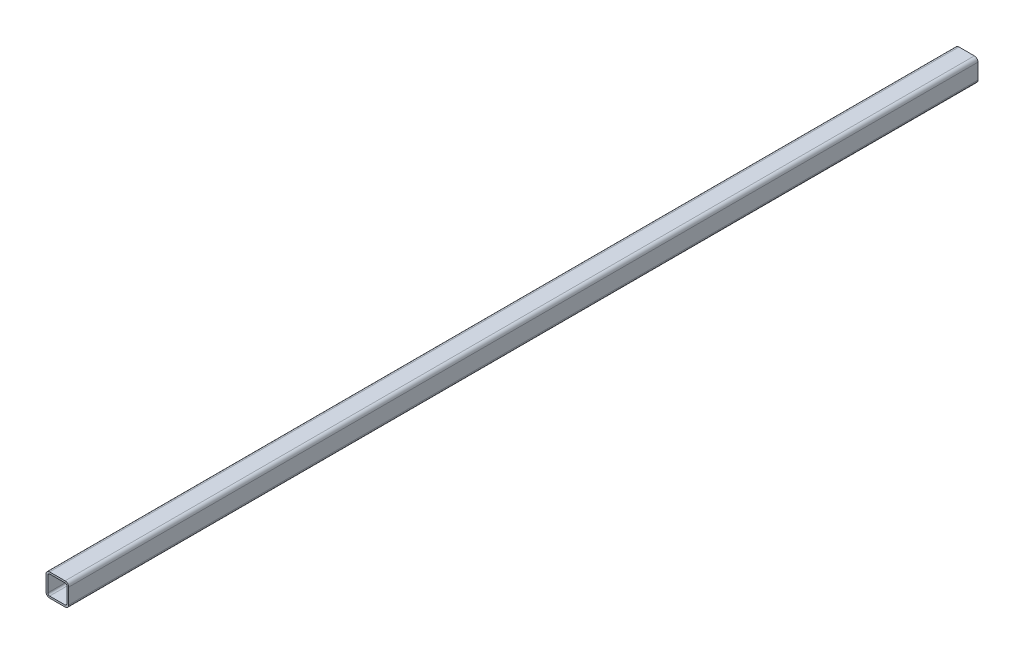
ISO-10303-21;
HEADER;
FILE_DESCRIPTION(('STEP AP214'),'2;1');
FILE_NAME('part.step','',(''),(''),'','','');
FILE_SCHEMA(('AUTOMOTIVE_DESIGN { 1 0 10303 214 1 1 1 1 }'));
ENDSEC;
DATA;
#1=APPLICATION_CONTEXT('core data for automotive mechanical design processes');
#2=APPLICATION_PROTOCOL_DEFINITION('international standard','automotive_design',2000,#1);
#3=PRODUCT_CONTEXT('',#1,'mechanical');
#4=PRODUCT('Part','Part','',(#3));
#5=PRODUCT_RELATED_PRODUCT_CATEGORY('part','',(#4));
#6=PRODUCT_DEFINITION_FORMATION('','',#4);
#7=PRODUCT_DEFINITION_CONTEXT('part definition',#1,'design');
#8=PRODUCT_DEFINITION('design','',#6,#7);
#9=PRODUCT_DEFINITION_SHAPE('','',#8);
#10=(LENGTH_UNIT() NAMED_UNIT(*) SI_UNIT(.MILLI.,.METRE.));
#11=(NAMED_UNIT(*) PLANE_ANGLE_UNIT() SI_UNIT($,.RADIAN.));
#12=(NAMED_UNIT(*) SI_UNIT($,.STERADIAN.) SOLID_ANGLE_UNIT());
#13=UNCERTAINTY_MEASURE_WITH_UNIT(LENGTH_MEASURE(1.E-05),#10,'distance_accuracy_value','');
#14=(GEOMETRIC_REPRESENTATION_CONTEXT(3) GLOBAL_UNCERTAINTY_ASSIGNED_CONTEXT((#13)) GLOBAL_UNIT_ASSIGNED_CONTEXT((#10,
#11,#12)) REPRESENTATION_CONTEXT('',''));
#15=CARTESIAN_POINT('',(0.,0.,0.));
#16=DIRECTION('',(0.,0.,1.));
#17=DIRECTION('',(1.,0.,0.));
#18=AXIS2_PLACEMENT_3D('',#15,#16,#17);
#19=CARTESIAN_POINT('',(33.6,33.6,800.));
#20=DIRECTION('',(0.,0.,1.));
#21=DIRECTION('',(1.,0.,0.));
#22=AXIS2_PLACEMENT_3D('',#19,#20,#21);
#23=PLANE('',#22);
#24=CARTESIAN_POINT('',(33.6,33.6,800.));
#25=DIRECTION('',(0.,0.,1.));
#26=DIRECTION('',(1.,0.,0.));
#27=AXIS2_PLACEMENT_3D('',#24,#25,#26);
#28=CIRCLE('',#27,6.4);
#29=CARTESIAN_POINT('',(40.,33.6,800.));
#30=VERTEX_POINT('',#29);
#31=CARTESIAN_POINT('',(33.6,40.,800.));
#32=VERTEX_POINT('',#31);
#33=EDGE_CURVE('E212',#30,#32,#28,.T.);
#34=ORIENTED_EDGE('',*,*,#33,.T.);
#35=DIRECTION('',(-1.,0.,0.));
#36=VECTOR('',#35,1.);
#37=CARTESIAN_POINT('',(33.6,40.,800.));
#38=LINE('',#37,#36);
#39=CARTESIAN_POINT('',(6.4,40.,800.));
#40=VERTEX_POINT('',#39);
#41=EDGE_CURVE('E215',#32,#40,#38,.T.);
#42=ORIENTED_EDGE('',*,*,#41,.T.);
#43=CARTESIAN_POINT('',(6.4,33.6,800.));
#44=DIRECTION('',(0.,0.,1.));
#45=DIRECTION('',(1.,0.,0.));
#46=AXIS2_PLACEMENT_3D('',#43,#44,#45);
#47=CIRCLE('',#46,6.40000000000001);
#48=CARTESIAN_POINT('',(0.,33.6,800.));
#49=VERTEX_POINT('',#48);
#50=EDGE_CURVE('E218',#40,#49,#47,.T.);
#51=ORIENTED_EDGE('',*,*,#50,.T.);
#52=DIRECTION('',(0.,-1.,0.));
#53=VECTOR('',#52,1.);
#54=CARTESIAN_POINT('',(0.,6.4,800.));
#55=LINE('',#54,#53);
#56=CARTESIAN_POINT('',(0.,6.4,800.));
#57=VERTEX_POINT('',#56);
#58=EDGE_CURVE('E220',#49,#57,#55,.T.);
#59=ORIENTED_EDGE('',*,*,#58,.T.);
#60=CARTESIAN_POINT('',(6.4,6.4,800.));
#61=DIRECTION('',(0.,0.,1.));
#62=DIRECTION('',(1.,0.,0.));
#63=AXIS2_PLACEMENT_3D('',#60,#61,#62);
#64=CIRCLE('',#63,6.4);
#65=CARTESIAN_POINT('',(6.4,0.,800.));
#66=VERTEX_POINT('',#65);
#67=EDGE_CURVE('E222',#57,#66,#64,.T.);
#68=ORIENTED_EDGE('',*,*,#67,.T.);
#69=DIRECTION('',(1.,0.,0.));
#70=VECTOR('',#69,1.);
#71=CARTESIAN_POINT('',(6.4,0.,800.));
#72=LINE('',#71,#70);
#73=CARTESIAN_POINT('',(33.6,0.,800.));
#74=VERTEX_POINT('',#73);
#75=EDGE_CURVE('E224',#66,#74,#72,.T.);
#76=ORIENTED_EDGE('',*,*,#75,.T.);
#77=CARTESIAN_POINT('',(33.6,6.4,800.));
#78=DIRECTION('',(0.,0.,1.));
#79=DIRECTION('',(1.,0.,0.));
#80=AXIS2_PLACEMENT_3D('',#77,#78,#79);
#81=CIRCLE('',#80,6.4);
#82=CARTESIAN_POINT('',(40.,6.4,800.));
#83=VERTEX_POINT('',#82);
#84=EDGE_CURVE('E226',#74,#83,#81,.T.);
#85=ORIENTED_EDGE('',*,*,#84,.T.);
#86=DIRECTION('',(0.,1.,0.));
#87=VECTOR('',#86,1.);
#88=CARTESIAN_POINT('',(40.,33.6,800.));
#89=LINE('',#88,#87);
#90=EDGE_CURVE('E228',#83,#30,#89,.T.);
#91=ORIENTED_EDGE('',*,*,#90,.T.);
#92=EDGE_LOOP('',(#34,#42,#51,#59,#68,#76,#85,#91));
#93=FACE_BOUND('',#92,.T.);
#94=DIRECTION('',(0.,-1.,0.));
#95=VECTOR('',#94,1.);
#96=CARTESIAN_POINT('',(3.2,6.4,800.));
#97=LINE('',#96,#95);
#98=CARTESIAN_POINT('',(3.2,33.6,800.));
#99=VERTEX_POINT('',#98);
#100=CARTESIAN_POINT('',(3.2,6.4,800.));
#101=VERTEX_POINT('',#100);
#102=EDGE_CURVE('E155',#99,#101,#97,.T.);
#103=ORIENTED_EDGE('',*,*,#102,.F.);
#104=CARTESIAN_POINT('',(6.4,33.6,800.));
#105=DIRECTION('',(0.,0.,1.));
#106=DIRECTION('',(1.,0.,0.));
#107=AXIS2_PLACEMENT_3D('',#104,#105,#106);
#108=CIRCLE('',#107,3.2);
#109=CARTESIAN_POINT('',(6.4,36.8,800.));
#110=VERTEX_POINT('',#109);
#111=EDGE_CURVE('E147',#110,#99,#108,.T.);
#112=ORIENTED_EDGE('',*,*,#111,.F.);
#113=DIRECTION('',(-1.,0.,0.));
#114=VECTOR('',#113,1.);
#115=CARTESIAN_POINT('',(33.6,36.8,800.));
#116=LINE('',#115,#114);
#117=CARTESIAN_POINT('',(33.6,36.8,800.));
#118=VERTEX_POINT('',#117);
#119=EDGE_CURVE('E180',#118,#110,#116,.T.);
#120=ORIENTED_EDGE('',*,*,#119,.F.);
#121=CARTESIAN_POINT('',(33.6,33.6,800.));
#122=DIRECTION('',(0.,0.,1.));
#123=DIRECTION('',(1.,0.,0.));
#124=AXIS2_PLACEMENT_3D('',#121,#122,#123);
#125=CIRCLE('',#124,3.2);
#126=CARTESIAN_POINT('',(36.8,33.6,800.));
#127=VERTEX_POINT('',#126);
#128=EDGE_CURVE('E178',#127,#118,#125,.T.);
#129=ORIENTED_EDGE('',*,*,#128,.F.);
#130=DIRECTION('',(0.,1.,0.));
#131=VECTOR('',#130,1.);
#132=CARTESIAN_POINT('',(36.8,33.6,800.));
#133=LINE('',#132,#131);
#134=CARTESIAN_POINT('',(36.8,6.4,800.));
#135=VERTEX_POINT('',#134);
#136=EDGE_CURVE('E176',#135,#127,#133,.T.);
#137=ORIENTED_EDGE('',*,*,#136,.F.);
#138=CARTESIAN_POINT('',(33.6,6.4,800.));
#139=DIRECTION('',(0.,0.,1.));
#140=DIRECTION('',(1.,0.,0.));
#141=AXIS2_PLACEMENT_3D('',#138,#139,#140);
#142=CIRCLE('',#141,3.20000000000001);
#143=CARTESIAN_POINT('',(33.6,3.2,800.));
#144=VERTEX_POINT('',#143);
#145=EDGE_CURVE('E174',#144,#135,#142,.T.);
#146=ORIENTED_EDGE('',*,*,#145,.F.);
#147=DIRECTION('',(1.,0.,0.));
#148=VECTOR('',#147,1.);
#149=CARTESIAN_POINT('',(6.4,3.2,800.));
#150=LINE('',#149,#148);
#151=CARTESIAN_POINT('',(6.4,3.2,800.));
#152=VERTEX_POINT('',#151);
#153=EDGE_CURVE('E170',#152,#144,#150,.T.);
#154=ORIENTED_EDGE('',*,*,#153,.F.);
#155=CARTESIAN_POINT('',(6.4,6.4,800.));
#156=DIRECTION('',(0.,0.,1.));
#157=DIRECTION('',(1.,0.,0.));
#158=AXIS2_PLACEMENT_3D('',#155,#156,#157);
#159=CIRCLE('',#158,3.2);
#160=EDGE_CURVE('E168',#101,#152,#159,.T.);
#161=ORIENTED_EDGE('',*,*,#160,.F.);
#162=EDGE_LOOP('',(#103,#112,#120,#129,#137,#146,#154,#161));
#163=FACE_BOUND('',#162,.T.);
#164=ADVANCED_FACE('F34',(#93,#163),#23,.T.);
#165=CARTESIAN_POINT('',(33.6,33.6,-800.));
#166=DIRECTION('',(0.,0.,1.));
#167=DIRECTION('',(1.,0.,0.));
#168=AXIS2_PLACEMENT_3D('',#165,#166,#167);
#169=PLANE('',#168);
#170=CARTESIAN_POINT('',(33.6,33.6,-800.));
#171=DIRECTION('',(0.,0.,1.));
#172=DIRECTION('',(1.,0.,0.));
#173=AXIS2_PLACEMENT_3D('',#170,#171,#172);
#174=CIRCLE('',#173,6.4);
#175=CARTESIAN_POINT('',(40.,33.6,-800.));
#176=VERTEX_POINT('',#175);
#177=CARTESIAN_POINT('',(33.6,40.,-800.));
#178=VERTEX_POINT('',#177);
#179=EDGE_CURVE('E163',#176,#178,#174,.T.);
#180=ORIENTED_EDGE('',*,*,#179,.F.);
#181=DIRECTION('',(0.,1.,0.));
#182=VECTOR('',#181,1.);
#183=CARTESIAN_POINT('',(40.,33.6,-800.));
#184=LINE('',#183,#182);
#185=CARTESIAN_POINT('',(40.,6.4,-800.));
#186=VERTEX_POINT('',#185);
#187=EDGE_CURVE('E216',#186,#176,#184,.T.);
#188=ORIENTED_EDGE('',*,*,#187,.F.);
#189=CARTESIAN_POINT('',(33.6,6.4,-800.));
#190=DIRECTION('',(0.,0.,1.));
#191=DIRECTION('',(1.,0.,0.));
#192=AXIS2_PLACEMENT_3D('',#189,#190,#191);
#193=CIRCLE('',#192,6.4);
#194=CARTESIAN_POINT('',(33.6,0.,-800.));
#195=VERTEX_POINT('',#194);
#196=EDGE_CURVE('E243',#195,#186,#193,.T.);
#197=ORIENTED_EDGE('',*,*,#196,.F.);
#198=DIRECTION('',(1.,0.,0.));
#199=VECTOR('',#198,1.);
#200=CARTESIAN_POINT('',(6.4,0.,-800.));
#201=LINE('',#200,#199);
#202=CARTESIAN_POINT('',(6.4,0.,-800.));
#203=VERTEX_POINT('',#202);
#204=EDGE_CURVE('E241',#203,#195,#201,.T.);
#205=ORIENTED_EDGE('',*,*,#204,.F.);
#206=CARTESIAN_POINT('',(6.4,6.4,-800.));
#207=DIRECTION('',(0.,0.,1.));
#208=DIRECTION('',(1.,0.,0.));
#209=AXIS2_PLACEMENT_3D('',#206,#207,#208);
#210=CIRCLE('',#209,6.4);
#211=CARTESIAN_POINT('',(0.,6.4,-800.));
#212=VERTEX_POINT('',#211);
#213=EDGE_CURVE('E239',#212,#203,#210,.T.);
#214=ORIENTED_EDGE('',*,*,#213,.F.);
#215=DIRECTION('',(0.,-1.,0.));
#216=VECTOR('',#215,1.);
#217=CARTESIAN_POINT('',(0.,6.4,-800.));
#218=LINE('',#217,#216);
#219=CARTESIAN_POINT('',(0.,33.6,-800.));
#220=VERTEX_POINT('',#219);
#221=EDGE_CURVE('E237',#220,#212,#218,.T.);
#222=ORIENTED_EDGE('',*,*,#221,.F.);
#223=CARTESIAN_POINT('',(6.4,33.6,-800.));
#224=DIRECTION('',(0.,0.,1.));
#225=DIRECTION('',(1.,0.,0.));
#226=AXIS2_PLACEMENT_3D('',#223,#224,#225);
#227=CIRCLE('',#226,6.40000000000001);
#228=CARTESIAN_POINT('',(6.4,40.,-800.));
#229=VERTEX_POINT('',#228);
#230=EDGE_CURVE('E235',#229,#220,#227,.T.);
#231=ORIENTED_EDGE('',*,*,#230,.F.);
#232=DIRECTION('',(-1.,0.,0.));
#233=VECTOR('',#232,1.);
#234=CARTESIAN_POINT('',(33.6,40.,-800.));
#235=LINE('',#234,#233);
#236=EDGE_CURVE('E233',#178,#229,#235,.T.);
#237=ORIENTED_EDGE('',*,*,#236,.F.);
#238=EDGE_LOOP('',(#180,#188,#197,#205,#214,#222,#231,#237));
#239=FACE_BOUND('',#238,.T.);
#240=CARTESIAN_POINT('',(6.4,33.6,-800.));
#241=DIRECTION('',(0.,0.,1.));
#242=DIRECTION('',(1.,0.,0.));
#243=AXIS2_PLACEMENT_3D('',#240,#241,#242);
#244=CIRCLE('',#243,3.2);
#245=CARTESIAN_POINT('',(6.4,36.8,-800.));
#246=VERTEX_POINT('',#245);
#247=CARTESIAN_POINT('',(3.2,33.6,-800.));
#248=VERTEX_POINT('',#247);
#249=EDGE_CURVE('E57',#246,#248,#244,.T.);
#250=ORIENTED_EDGE('',*,*,#249,.T.);
#251=DIRECTION('',(0.,-1.,0.));
#252=VECTOR('',#251,1.);
#253=CARTESIAN_POINT('',(3.2,6.4,-800.));
#254=LINE('',#253,#252);
#255=CARTESIAN_POINT('',(3.2,6.4,-800.));
#256=VERTEX_POINT('',#255);
#257=EDGE_CURVE('E162',#248,#256,#254,.T.);
#258=ORIENTED_EDGE('',*,*,#257,.T.);
#259=CARTESIAN_POINT('',(6.4,6.4,-800.));
#260=DIRECTION('',(0.,0.,1.));
#261=DIRECTION('',(1.,0.,0.));
#262=AXIS2_PLACEMENT_3D('',#259,#260,#261);
#263=CIRCLE('',#262,3.2);
#264=CARTESIAN_POINT('',(6.4,3.2,-800.));
#265=VERTEX_POINT('',#264);
#266=EDGE_CURVE('E184',#256,#265,#263,.T.);
#267=ORIENTED_EDGE('',*,*,#266,.T.);
#268=DIRECTION('',(1.,0.,0.));
#269=VECTOR('',#268,1.);
#270=CARTESIAN_POINT('',(6.4,3.2,-800.));
#271=LINE('',#270,#269);
#272=CARTESIAN_POINT('',(33.6,3.2,-800.));
#273=VERTEX_POINT('',#272);
#274=EDGE_CURVE('E187',#265,#273,#271,.T.);
#275=ORIENTED_EDGE('',*,*,#274,.T.);
#276=CARTESIAN_POINT('',(33.6,6.4,-800.));
#277=DIRECTION('',(0.,0.,1.));
#278=DIRECTION('',(1.,0.,0.));
#279=AXIS2_PLACEMENT_3D('',#276,#277,#278);
#280=CIRCLE('',#279,3.20000000000001);
#281=CARTESIAN_POINT('',(36.8,6.4,-800.));
#282=VERTEX_POINT('',#281);
#283=EDGE_CURVE('E190',#273,#282,#280,.T.);
#284=ORIENTED_EDGE('',*,*,#283,.T.);
#285=DIRECTION('',(0.,1.,0.));
#286=VECTOR('',#285,1.);
#287=CARTESIAN_POINT('',(36.8,33.6,-800.));
#288=LINE('',#287,#286);
#289=CARTESIAN_POINT('',(36.8,33.6,-800.));
#290=VERTEX_POINT('',#289);
#291=EDGE_CURVE('E193',#282,#290,#288,.T.);
#292=ORIENTED_EDGE('',*,*,#291,.T.);
#293=CARTESIAN_POINT('',(33.6,33.6,-800.));
#294=DIRECTION('',(0.,0.,1.));
#295=DIRECTION('',(1.,0.,0.));
#296=AXIS2_PLACEMENT_3D('',#293,#294,#295);
#297=CIRCLE('',#296,3.2);
#298=CARTESIAN_POINT('',(33.6,36.8,-800.));
#299=VERTEX_POINT('',#298);
#300=EDGE_CURVE('E196',#290,#299,#297,.T.);
#301=ORIENTED_EDGE('',*,*,#300,.T.);
#302=DIRECTION('',(-1.,0.,0.));
#303=VECTOR('',#302,1.);
#304=CARTESIAN_POINT('',(33.6,36.8,-800.));
#305=LINE('',#304,#303);
#306=EDGE_CURVE('E156',#299,#246,#305,.T.);
#307=ORIENTED_EDGE('',*,*,#306,.T.);
#308=EDGE_LOOP('',(#250,#258,#267,#275,#284,#292,#301,#307));
#309=FACE_BOUND('',#308,.T.);
#310=ADVANCED_FACE('F273',(#239,#309),#169,.F.);
#311=CARTESIAN_POINT('',(33.6,33.6,800.));
#312=DIRECTION('',(0.,0.,-1.));
#313=DIRECTION('',(-1.,0.,0.));
#314=AXIS2_PLACEMENT_3D('',#311,#312,#313);
#315=CYLINDRICAL_SURFACE('',#314,6.4);
#316=ORIENTED_EDGE('',*,*,#179,.T.);
#317=DIRECTION('',(0.,0.,-1.));
#318=VECTOR('',#317,1.);
#319=CARTESIAN_POINT('',(33.6,40.,800.));
#320=LINE('',#319,#318);
#321=EDGE_CURVE('E11',#32,#178,#320,.T.);
#322=ORIENTED_EDGE('',*,*,#321,.F.);
#323=ORIENTED_EDGE('',*,*,#33,.F.);
#324=DIRECTION('',(0.,0.,-1.));
#325=VECTOR('',#324,1.);
#326=CARTESIAN_POINT('',(40.,33.6,800.));
#327=LINE('',#326,#325);
#328=EDGE_CURVE('E230',#30,#176,#327,.T.);
#329=ORIENTED_EDGE('',*,*,#328,.T.);
#330=EDGE_LOOP('',(#316,#322,#323,#329));
#331=FACE_BOUND('',#330,.T.);
#332=ADVANCED_FACE('F36',(#331),#315,.T.);
#333=CARTESIAN_POINT('',(33.6,40.,800.));
#334=DIRECTION('',(0.,-1.,0.));
#335=DIRECTION('',(0.,0.,-1.));
#336=AXIS2_PLACEMENT_3D('',#333,#334,#335);
#337=PLANE('',#336);
#338=ORIENTED_EDGE('',*,*,#236,.T.);
#339=DIRECTION('',(0.,0.,-1.));
#340=VECTOR('',#339,1.);
#341=CARTESIAN_POINT('',(6.4,40.,800.));
#342=LINE('',#341,#340);
#343=EDGE_CURVE('E42',#40,#229,#342,.T.);
#344=ORIENTED_EDGE('',*,*,#343,.F.);
#345=ORIENTED_EDGE('',*,*,#41,.F.);
#346=ORIENTED_EDGE('',*,*,#321,.T.);
#347=EDGE_LOOP('',(#338,#344,#345,#346));
#348=FACE_BOUND('',#347,.T.);
#349=ADVANCED_FACE('F290',(#348),#337,.F.);
#350=CARTESIAN_POINT('',(6.4,33.6,800.));
#351=DIRECTION('',(0.,0.,-1.));
#352=DIRECTION('',(-1.,0.,0.));
#353=AXIS2_PLACEMENT_3D('',#350,#351,#352);
#354=CYLINDRICAL_SURFACE('',#353,6.40000000000001);
#355=ORIENTED_EDGE('',*,*,#230,.T.);
#356=DIRECTION('',(0.,0.,-1.));
#357=VECTOR('',#356,1.);
#358=CARTESIAN_POINT('',(0.,33.6,800.));
#359=LINE('',#358,#357);
#360=EDGE_CURVE('E260',#49,#220,#359,.T.);
#361=ORIENTED_EDGE('',*,*,#360,.F.);
#362=ORIENTED_EDGE('',*,*,#50,.F.);
#363=ORIENTED_EDGE('',*,*,#343,.T.);
#364=EDGE_LOOP('',(#355,#361,#362,#363));
#365=FACE_BOUND('',#364,.T.);
#366=ADVANCED_FACE('F267',(#365),#354,.T.);
#367=CARTESIAN_POINT('',(0.,6.4,800.));
#368=DIRECTION('',(1.,0.,0.));
#369=DIRECTION('',(0.,1.,0.));
#370=AXIS2_PLACEMENT_3D('',#367,#368,#369);
#371=PLANE('',#370);
#372=ORIENTED_EDGE('',*,*,#221,.T.);
#373=DIRECTION('',(0.,0.,-1.));
#374=VECTOR('',#373,1.);
#375=CARTESIAN_POINT('',(0.,6.4,800.));
#376=LINE('',#375,#374);
#377=EDGE_CURVE('E257',#57,#212,#376,.T.);
#378=ORIENTED_EDGE('',*,*,#377,.F.);
#379=ORIENTED_EDGE('',*,*,#58,.F.);
#380=ORIENTED_EDGE('',*,*,#360,.T.);
#381=EDGE_LOOP('',(#372,#378,#379,#380));
#382=FACE_BOUND('',#381,.T.);
#383=ADVANCED_FACE('F279',(#382),#371,.F.);
#384=CARTESIAN_POINT('',(6.4,6.4,800.));
#385=DIRECTION('',(0.,0.,-1.));
#386=DIRECTION('',(-1.,0.,0.));
#387=AXIS2_PLACEMENT_3D('',#384,#385,#386);
#388=CYLINDRICAL_SURFACE('',#387,6.4);
#389=ORIENTED_EDGE('',*,*,#213,.T.);
#390=DIRECTION('',(0.,0.,-1.));
#391=VECTOR('',#390,1.);
#392=CARTESIAN_POINT('',(6.4,0.,800.));
#393=LINE('',#392,#391);
#394=EDGE_CURVE('E254',#66,#203,#393,.T.);
#395=ORIENTED_EDGE('',*,*,#394,.F.);
#396=ORIENTED_EDGE('',*,*,#67,.F.);
#397=ORIENTED_EDGE('',*,*,#377,.T.);
#398=EDGE_LOOP('',(#389,#395,#396,#397));
#399=FACE_BOUND('',#398,.T.);
#400=ADVANCED_FACE('F283',(#399),#388,.T.);
#401=CARTESIAN_POINT('',(6.4,0.,800.));
#402=DIRECTION('',(0.,1.,0.));
#403=DIRECTION('',(-1.,0.,0.));
#404=AXIS2_PLACEMENT_3D('',#401,#402,#403);
#405=PLANE('',#404);
#406=ORIENTED_EDGE('',*,*,#204,.T.);
#407=DIRECTION('',(0.,0.,-1.));
#408=VECTOR('',#407,1.);
#409=CARTESIAN_POINT('',(33.6,0.,800.));
#410=LINE('',#409,#408);
#411=EDGE_CURVE('E251',#74,#195,#410,.T.);
#412=ORIENTED_EDGE('',*,*,#411,.F.);
#413=ORIENTED_EDGE('',*,*,#75,.F.);
#414=ORIENTED_EDGE('',*,*,#394,.T.);
#415=EDGE_LOOP('',(#406,#412,#413,#414));
#416=FACE_BOUND('',#415,.T.);
#417=ADVANCED_FACE('F303',(#416),#405,.F.);
#418=CARTESIAN_POINT('',(33.6,6.4,800.));
#419=DIRECTION('',(0.,0.,-1.));
#420=DIRECTION('',(-1.,0.,0.));
#421=AXIS2_PLACEMENT_3D('',#418,#419,#420);
#422=CYLINDRICAL_SURFACE('',#421,6.4);
#423=ORIENTED_EDGE('',*,*,#196,.T.);
#424=DIRECTION('',(0.,0.,-1.));
#425=VECTOR('',#424,1.);
#426=CARTESIAN_POINT('',(40.,6.4,800.));
#427=LINE('',#426,#425);
#428=EDGE_CURVE('E248',#83,#186,#427,.T.);
#429=ORIENTED_EDGE('',*,*,#428,.F.);
#430=ORIENTED_EDGE('',*,*,#84,.F.);
#431=ORIENTED_EDGE('',*,*,#411,.T.);
#432=EDGE_LOOP('',(#423,#429,#430,#431));
#433=FACE_BOUND('',#432,.T.);
#434=ADVANCED_FACE('F301',(#433),#422,.T.);
#435=CARTESIAN_POINT('',(40.,33.6,800.));
#436=DIRECTION('',(-1.,0.,0.));
#437=DIRECTION('',(0.,0.,1.));
#438=AXIS2_PLACEMENT_3D('',#435,#436,#437);
#439=PLANE('',#438);
#440=ORIENTED_EDGE('',*,*,#187,.T.);
#441=ORIENTED_EDGE('',*,*,#328,.F.);
#442=ORIENTED_EDGE('',*,*,#90,.F.);
#443=ORIENTED_EDGE('',*,*,#428,.T.);
#444=EDGE_LOOP('',(#440,#441,#442,#443));
#445=FACE_BOUND('',#444,.T.);
#446=ADVANCED_FACE('F296',(#445),#439,.F.);
#447=CARTESIAN_POINT('',(6.4,33.6,800.));
#448=DIRECTION('',(0.,0.,-1.));
#449=DIRECTION('',(-1.,0.,0.));
#450=AXIS2_PLACEMENT_3D('',#447,#448,#449);
#451=CYLINDRICAL_SURFACE('',#450,3.2);
#452=ORIENTED_EDGE('',*,*,#249,.F.);
#453=DIRECTION('',(0.,0.,-1.));
#454=VECTOR('',#453,1.);
#455=CARTESIAN_POINT('',(6.4,36.8,800.));
#456=LINE('',#455,#454);
#457=EDGE_CURVE('E151',#110,#246,#456,.T.);
#458=ORIENTED_EDGE('',*,*,#457,.F.);
#459=ORIENTED_EDGE('',*,*,#111,.T.);
#460=DIRECTION('',(0.,0.,-1.));
#461=VECTOR('',#460,1.);
#462=CARTESIAN_POINT('',(3.2,33.6,800.));
#463=LINE('',#462,#461);
#464=EDGE_CURVE('E150',#99,#248,#463,.T.);
#465=ORIENTED_EDGE('',*,*,#464,.T.);
#466=EDGE_LOOP('',(#452,#458,#459,#465));
#467=FACE_BOUND('',#466,.T.);
#468=ADVANCED_FACE('F149',(#467),#451,.F.);
#469=CARTESIAN_POINT('',(3.2,6.4,800.));
#470=DIRECTION('',(1.,0.,0.));
#471=DIRECTION('',(0.,0.,-1.));
#472=AXIS2_PLACEMENT_3D('',#469,#470,#471);
#473=PLANE('',#472);
#474=ORIENTED_EDGE('',*,*,#257,.F.);
#475=ORIENTED_EDGE('',*,*,#464,.F.);
#476=ORIENTED_EDGE('',*,*,#102,.T.);
#477=DIRECTION('',(0.,0.,-1.));
#478=VECTOR('',#477,1.);
#479=CARTESIAN_POINT('',(3.2,6.4,800.));
#480=LINE('',#479,#478);
#481=EDGE_CURVE('E164',#101,#256,#480,.T.);
#482=ORIENTED_EDGE('',*,*,#481,.T.);
#483=EDGE_LOOP('',(#474,#475,#476,#482));
#484=FACE_BOUND('',#483,.T.);
#485=ADVANCED_FACE('F159',(#484),#473,.T.);
#486=CARTESIAN_POINT('',(6.4,6.4,800.));
#487=DIRECTION('',(0.,0.,-1.));
#488=DIRECTION('',(-1.,0.,0.));
#489=AXIS2_PLACEMENT_3D('',#486,#487,#488);
#490=CYLINDRICAL_SURFACE('',#489,3.2);
#491=ORIENTED_EDGE('',*,*,#266,.F.);
#492=ORIENTED_EDGE('',*,*,#481,.F.);
#493=ORIENTED_EDGE('',*,*,#160,.T.);
#494=DIRECTION('',(0.,0.,-1.));
#495=VECTOR('',#494,1.);
#496=CARTESIAN_POINT('',(6.4,3.2,800.));
#497=LINE('',#496,#495);
#498=EDGE_CURVE('E209',#152,#265,#497,.T.);
#499=ORIENTED_EDGE('',*,*,#498,.T.);
#500=EDGE_LOOP('',(#491,#492,#493,#499));
#501=FACE_BOUND('',#500,.T.);
#502=ADVANCED_FACE('F328',(#501),#490,.F.);
#503=CARTESIAN_POINT('',(6.4,3.2,800.));
#504=DIRECTION('',(0.,1.,0.));
#505=DIRECTION('',(-1.,0.,0.));
#506=AXIS2_PLACEMENT_3D('',#503,#504,#505);
#507=PLANE('',#506);
#508=ORIENTED_EDGE('',*,*,#274,.F.);
#509=ORIENTED_EDGE('',*,*,#498,.F.);
#510=ORIENTED_EDGE('',*,*,#153,.T.);
#511=DIRECTION('',(0.,0.,-1.));
#512=VECTOR('',#511,1.);
#513=CARTESIAN_POINT('',(33.6,3.2,800.));
#514=LINE('',#513,#512);
#515=EDGE_CURVE('E207',#144,#273,#514,.T.);
#516=ORIENTED_EDGE('',*,*,#515,.T.);
#517=EDGE_LOOP('',(#508,#509,#510,#516));
#518=FACE_BOUND('',#517,.T.);
#519=ADVANCED_FACE('F332',(#518),#507,.T.);
#520=CARTESIAN_POINT('',(33.6,6.4,800.));
#521=DIRECTION('',(0.,0.,-1.));
#522=DIRECTION('',(-1.,0.,0.));
#523=AXIS2_PLACEMENT_3D('',#520,#521,#522);
#524=CYLINDRICAL_SURFACE('',#523,3.20000000000001);
#525=ORIENTED_EDGE('',*,*,#283,.F.);
#526=ORIENTED_EDGE('',*,*,#515,.F.);
#527=ORIENTED_EDGE('',*,*,#145,.T.);
#528=DIRECTION('',(0.,0.,-1.));
#529=VECTOR('',#528,1.);
#530=CARTESIAN_POINT('',(36.8,6.4,800.));
#531=LINE('',#530,#529);
#532=EDGE_CURVE('E205',#135,#282,#531,.T.);
#533=ORIENTED_EDGE('',*,*,#532,.T.);
#534=EDGE_LOOP('',(#525,#526,#527,#533));
#535=FACE_BOUND('',#534,.T.);
#536=ADVANCED_FACE('F338',(#535),#524,.F.);
#537=CARTESIAN_POINT('',(36.8,33.6,800.));
#538=DIRECTION('',(-1.,0.,0.));
#539=DIRECTION('',(0.,-1.,0.));
#540=AXIS2_PLACEMENT_3D('',#537,#538,#539);
#541=PLANE('',#540);
#542=ORIENTED_EDGE('',*,*,#291,.F.);
#543=ORIENTED_EDGE('',*,*,#532,.F.);
#544=ORIENTED_EDGE('',*,*,#136,.T.);
#545=DIRECTION('',(0.,0.,-1.));
#546=VECTOR('',#545,1.);
#547=CARTESIAN_POINT('',(36.8,33.6,800.));
#548=LINE('',#547,#546);
#549=EDGE_CURVE('E203',#127,#290,#548,.T.);
#550=ORIENTED_EDGE('',*,*,#549,.T.);
#551=EDGE_LOOP('',(#542,#543,#544,#550));
#552=FACE_BOUND('',#551,.T.);
#553=ADVANCED_FACE('F342',(#552),#541,.T.);
#554=CARTESIAN_POINT('',(33.6,33.6,800.));
#555=DIRECTION('',(0.,0.,-1.));
#556=DIRECTION('',(-1.,0.,0.));
#557=AXIS2_PLACEMENT_3D('',#554,#555,#556);
#558=CYLINDRICAL_SURFACE('',#557,3.2);
#559=ORIENTED_EDGE('',*,*,#300,.F.);
#560=ORIENTED_EDGE('',*,*,#549,.F.);
#561=ORIENTED_EDGE('',*,*,#128,.T.);
#562=DIRECTION('',(0.,0.,-1.));
#563=VECTOR('',#562,1.);
#564=CARTESIAN_POINT('',(33.6,36.8,800.));
#565=LINE('',#564,#563);
#566=EDGE_CURVE('E49',#118,#299,#565,.T.);
#567=ORIENTED_EDGE('',*,*,#566,.T.);
#568=EDGE_LOOP('',(#559,#560,#561,#567));
#569=FACE_BOUND('',#568,.T.);
#570=ADVANCED_FACE('F346',(#569),#558,.F.);
#571=CARTESIAN_POINT('',(33.6,36.8,800.));
#572=DIRECTION('',(0.,-1.,0.));
#573=DIRECTION('',(1.,0.,0.));
#574=AXIS2_PLACEMENT_3D('',#571,#572,#573);
#575=PLANE('',#574);
#576=ORIENTED_EDGE('',*,*,#306,.F.);
#577=ORIENTED_EDGE('',*,*,#566,.F.);
#578=ORIENTED_EDGE('',*,*,#119,.T.);
#579=ORIENTED_EDGE('',*,*,#457,.T.);
#580=EDGE_LOOP('',(#576,#577,#578,#579));
#581=FACE_BOUND('',#580,.T.);
#582=ADVANCED_FACE('F350',(#581),#575,.T.);
#583=CLOSED_SHELL('',(#164,#310,#332,#349,#366,#383,#400,#417,#434,#446,#468,#485,#502,#519,
#536,#553,#570,#582));
#584=MANIFOLD_SOLID_BREP('B2',#583);
#585=ADVANCED_BREP_SHAPE_REPRESENTATION('',(#18,#584),#14);
#586=SHAPE_DEFINITION_REPRESENTATION(#9,#585);
ENDSEC;
END-ISO-10303-21;
